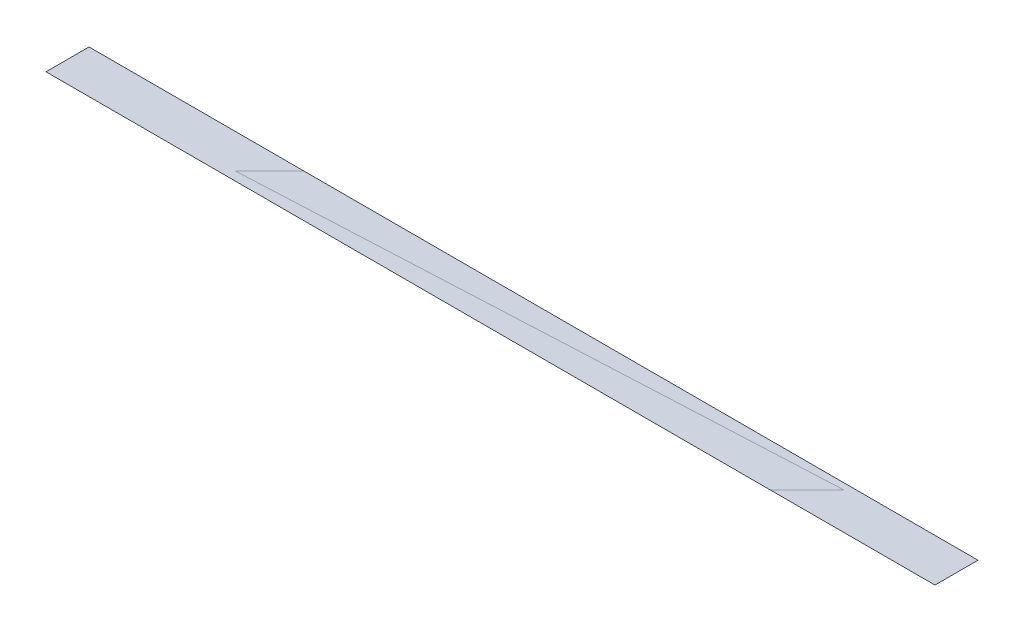
ISO-10303-21;
HEADER;
FILE_DESCRIPTION(('STEP AP214'),'2;1');
FILE_NAME('part.step','',(''),(''),'','','');
FILE_SCHEMA(('AUTOMOTIVE_DESIGN { 1 0 10303 214 1 1 1 1 }'));
ENDSEC;
DATA;
#1=APPLICATION_CONTEXT('core data for automotive mechanical design processes');
#2=APPLICATION_PROTOCOL_DEFINITION('international standard','automotive_design',2000,#1);
#3=PRODUCT_CONTEXT('',#1,'mechanical');
#4=PRODUCT('Part','Part','',(#3));
#5=PRODUCT_RELATED_PRODUCT_CATEGORY('part','',(#4));
#6=PRODUCT_DEFINITION_FORMATION('','',#4);
#7=PRODUCT_DEFINITION_CONTEXT('part definition',#1,'design');
#8=PRODUCT_DEFINITION('design','',#6,#7);
#9=PRODUCT_DEFINITION_SHAPE('','',#8);
#10=(LENGTH_UNIT() NAMED_UNIT(*) SI_UNIT(.MILLI.,.METRE.));
#11=(NAMED_UNIT(*) PLANE_ANGLE_UNIT() SI_UNIT($,.RADIAN.));
#12=(NAMED_UNIT(*) SI_UNIT($,.STERADIAN.) SOLID_ANGLE_UNIT());
#13=UNCERTAINTY_MEASURE_WITH_UNIT(LENGTH_MEASURE(1.E-05),#10,'distance_accuracy_value','');
#14=(GEOMETRIC_REPRESENTATION_CONTEXT(3) GLOBAL_UNCERTAINTY_ASSIGNED_CONTEXT((#13)) GLOBAL_UNIT_ASSIGNED_CONTEXT((#10,
#11,#12)) REPRESENTATION_CONTEXT('',''));
#15=CARTESIAN_POINT('',(0.,0.,0.));
#16=DIRECTION('',(0.,0.,1.));
#17=DIRECTION('',(1.,0.,0.));
#18=AXIS2_PLACEMENT_3D('',#15,#16,#17);
#19=CARTESIAN_POINT('',(-72.39500345023,-3.181385369229,-48.27363971795));
#20=DIRECTION('',(0.,1.,0.));
#21=DIRECTION('',(0.,0.,1.));
#22=AXIS2_PLACEMENT_3D('',#19,#20,#21);
#23=PLANE('',#22);
#24=CARTESIAN_POINT('',(-71.74500346333,-3.181385369229,-48.273639724));
#25=DIRECTION('',(1.,0.,0.));
#26=VECTOR('',#25,1.);
#27=LINE('',#24,#26);
#28=CARTESIAN_POINT('',(-71.7450034633057,-3.1818853376708,-48.2736397243648));
#29=VERTEX_POINT('',#28);
#30=CARTESIAN_POINT('',(-71.5450035594557,-3.18188532796066,-48.2736397243647));
#31=VERTEX_POINT('',#30);
#32=EDGE_CURVE('E40',#29,#31,#27,.T.);
#33=ORIENTED_EDGE('',*,*,#32,.T.);
#34=CARTESIAN_POINT('',(-71.54500355948,-3.181385369229,-48.273639724));
#35=DIRECTION('',(0.,0.,-1.));
#36=VECTOR('',#35,1.);
#37=LINE('',#34,#36);
#38=CARTESIAN_POINT('',(-71.5450035594557,-3.18188532089923,-48.2833185883047));
#39=VERTEX_POINT('',#38);
#40=EDGE_CURVE('E27',#31,#39,#37,.T.);
#41=ORIENTED_EDGE('',*,*,#40,.T.);
#42=CARTESIAN_POINT('',(-71.54500355948,-3.181385369229,-48.28331858794));
#43=DIRECTION('',(-1.,0.,0.));
#44=VECTOR('',#43,1.);
#45=LINE('',#42,#44);
#46=CARTESIAN_POINT('',(-71.7450034633057,-3.18188533060936,-48.2833185883048));
#47=VERTEX_POINT('',#46);
#48=EDGE_CURVE('E11',#39,#47,#45,.T.);
#49=ORIENTED_EDGE('',*,*,#48,.T.);
#50=CARTESIAN_POINT('',(-71.74500346333,-3.181385369229,-48.28331858794));
#51=DIRECTION('',(0.,0.,1.));
#52=VECTOR('',#51,1.);
#53=LINE('',#50,#52);
#54=EDGE_CURVE('E43',#47,#29,#53,.T.);
#55=ORIENTED_EDGE('',*,*,#54,.T.);
#56=EDGE_LOOP('',(#33,#41,#49,#55));
#57=FACE_BOUND('',#56,.T.);
#58=ADVANCED_FACE('F16',(#57),#23,.T.);
#59=CARTESIAN_POINT('',(-68.87102109308,-3.182385027045,-48.27363968113));
#60=DIRECTION('',(-9.71013813544533E-08,0.999999999998931,1.4591458069549E-06));
#61=DIRECTION('',(0.,-1.45914580695491E-06,0.999999999998936));
#62=AXIS2_PLACEMENT_3D('',#59,#60,#61);
#63=PLANE('',#62);
#64=ORIENTED_EDGE('',*,*,#40,.F.);
#65=ORIENTED_EDGE('',*,*,#32,.F.);
#66=ORIENTED_EDGE('',*,*,#54,.F.);
#67=ORIENTED_EDGE('',*,*,#48,.F.);
#68=EDGE_LOOP('',(#64,#65,#66,#67));
#69=FACE_BOUND('',#68,.T.);
#70=ADVANCED_FACE('F45',(#69),#63,.F.);
#71=CLOSED_SHELL('',(#58,#70));
#72=MANIFOLD_SOLID_BREP('B1',#71);
#73=ADVANCED_BREP_SHAPE_REPRESENTATION('',(#18,#72),#14);
#74=SHAPE_DEFINITION_REPRESENTATION(#9,#73);
ENDSEC;
END-ISO-10303-21;
